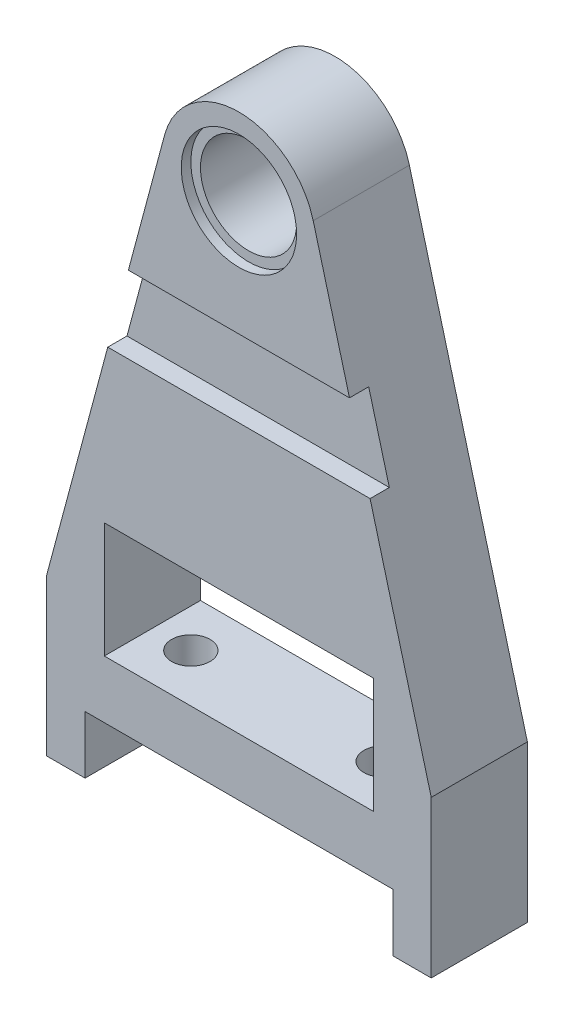
ISO-10303-21;
HEADER;
FILE_DESCRIPTION(('STEP AP214'),'2;1');
FILE_NAME('part.step','',(''),(''),'','','');
FILE_SCHEMA(('AUTOMOTIVE_DESIGN { 1 0 10303 214 1 1 1 1 }'));
ENDSEC;
DATA;
#1=APPLICATION_CONTEXT('core data for automotive mechanical design processes');
#2=APPLICATION_PROTOCOL_DEFINITION('international standard','automotive_design',2000,#1);
#3=PRODUCT_CONTEXT('',#1,'mechanical');
#4=PRODUCT('Part','Part','',(#3));
#5=PRODUCT_RELATED_PRODUCT_CATEGORY('part','',(#4));
#6=PRODUCT_DEFINITION_FORMATION('','',#4);
#7=PRODUCT_DEFINITION_CONTEXT('part definition',#1,'design');
#8=PRODUCT_DEFINITION('design','',#6,#7);
#9=PRODUCT_DEFINITION_SHAPE('','',#8);
#10=(LENGTH_UNIT() NAMED_UNIT(*) SI_UNIT(.MILLI.,.METRE.));
#11=(NAMED_UNIT(*) PLANE_ANGLE_UNIT() SI_UNIT($,.RADIAN.));
#12=(NAMED_UNIT(*) SI_UNIT($,.STERADIAN.) SOLID_ANGLE_UNIT());
#13=UNCERTAINTY_MEASURE_WITH_UNIT(LENGTH_MEASURE(1.E-05),#10,'distance_accuracy_value','');
#14=(GEOMETRIC_REPRESENTATION_CONTEXT(3) GLOBAL_UNCERTAINTY_ASSIGNED_CONTEXT((#13)) GLOBAL_UNIT_ASSIGNED_CONTEXT((#10,
#11,#12)) REPRESENTATION_CONTEXT('',''));
#15=CARTESIAN_POINT('',(0.,0.,0.));
#16=DIRECTION('',(0.,0.,1.));
#17=DIRECTION('',(1.,0.,0.));
#18=AXIS2_PLACEMENT_3D('',#15,#16,#17);
#19=CARTESIAN_POINT('',(0.,0.,25.));
#20=DIRECTION('',(0.,0.,1.));
#21=DIRECTION('',(1.,0.,0.));
#22=AXIS2_PLACEMENT_3D('',#19,#20,#21);
#23=PLANE('',#22);
#24=DIRECTION('',(-1.,0.,0.));
#25=VECTOR('',#24,1.);
#26=CARTESIAN_POINT('',(-57.4879987622707,240.,25.));
#27=LINE('',#26,#25);
#28=CARTESIAN_POINT('',(57.4879987622707,240.,25.));
#29=VERTEX_POINT('',#28);
#30=CARTESIAN_POINT('',(-57.4879987622707,240.,25.));
#31=VERTEX_POINT('',#30);
#32=EDGE_CURVE('E319',#29,#31,#27,.T.);
#33=ORIENTED_EDGE('',*,*,#32,.F.);
#34=DIRECTION('',(-0.258819045102521,0.965925826289068,0.));
#35=VECTOR('',#34,1.);
#36=CARTESIAN_POINT('',(113.637033051563,30.4489512364351,25.));
#37=LINE('',#36,#35);
#38=CARTESIAN_POINT('',(38.6370330515627,310.352761804101,25.));
#39=VERTEX_POINT('',#38);
#40=EDGE_CURVE('E264',#29,#39,#37,.T.);
#41=ORIENTED_EDGE('',*,*,#40,.T.);
#42=CARTESIAN_POINT('',(0.,300.,25.));
#43=DIRECTION('',(0.,0.,1.));
#44=DIRECTION('',(1.,0.,0.));
#45=AXIS2_PLACEMENT_3D('',#42,#43,#44);
#46=CIRCLE('',#45,40.);
#47=CARTESIAN_POINT('',(-38.6370330515627,310.352761804101,25.));
#48=VERTEX_POINT('',#47);
#49=EDGE_CURVE('E267',#39,#48,#46,.T.);
#50=ORIENTED_EDGE('',*,*,#49,.T.);
#51=DIRECTION('',(0.258819045102521,0.965925826289068,0.));
#52=VECTOR('',#51,1.);
#53=CARTESIAN_POINT('',(-113.637033051563,30.4489512364351,25.));
#54=LINE('',#53,#52);
#55=EDGE_CURVE('E270',#31,#48,#54,.T.);
#56=ORIENTED_EDGE('',*,*,#55,.F.);
#57=EDGE_LOOP('',(#33,#41,#50,#56));
#58=FACE_BOUND('',#57,.T.);
#59=CARTESIAN_POINT('',(0.,300.,25.));
#60=DIRECTION('',(0.,0.,1.));
#61=DIRECTION('',(1.,0.,0.));
#62=AXIS2_PLACEMENT_3D('',#59,#60,#61);
#63=CIRCLE('',#62,30.);
#64=CARTESIAN_POINT('',(30.,300.,25.));
#65=VERTEX_POINT('',#64);
#66=EDGE_CURVE('E246',#65,#65,#63,.T.);
#67=ORIENTED_EDGE('',*,*,#66,.F.);
#68=EDGE_LOOP('',(#67));
#69=FACE_BOUND('',#68,.T.);
#70=ADVANCED_FACE('F33',(#58,#69),#23,.T.);
#71=CARTESIAN_POINT('',(0.,300.,25.));
#72=DIRECTION('',(0.,0.,-1.));
#73=DIRECTION('',(-1.,0.,0.));
#74=AXIS2_PLACEMENT_3D('',#71,#72,#73);
#75=CYLINDRICAL_SURFACE('',#74,25.);
#76=CARTESIAN_POINT('',(0.,300.,20.));
#77=DIRECTION('',(0.,0.,1.));
#78=DIRECTION('',(1.,0.,0.));
#79=AXIS2_PLACEMENT_3D('',#76,#77,#78);
#80=CIRCLE('',#79,25.);
#81=CARTESIAN_POINT('',(25.,300.,20.));
#82=VERTEX_POINT('',#81);
#83=EDGE_CURVE('E187',#82,#82,#80,.T.);
#84=ORIENTED_EDGE('',*,*,#83,.T.);
#85=EDGE_LOOP('',(#84));
#86=FACE_BOUND('',#85,.T.);
#87=CARTESIAN_POINT('',(0.,300.,-20.));
#88=DIRECTION('',(0.,0.,-1.));
#89=DIRECTION('',(-1.,0.,0.));
#90=AXIS2_PLACEMENT_3D('',#87,#88,#89);
#91=CIRCLE('',#90,25.);
#92=CARTESIAN_POINT('',(-25.,300.,-20.));
#93=VERTEX_POINT('',#92);
#94=EDGE_CURVE('E37',#93,#93,#91,.T.);
#95=ORIENTED_EDGE('',*,*,#94,.T.);
#96=EDGE_LOOP('',(#95));
#97=FACE_BOUND('',#96,.T.);
#98=ADVANCED_FACE('F35',(#86,#97),#75,.F.);
#99=CARTESIAN_POINT('',(113.637033051563,30.4489512364351,25.));
#100=DIRECTION('',(-0.965925826289068,-0.258819045102521,0.));
#101=DIRECTION('',(0.258819045102521,-0.965925826289068,0.));
#102=AXIS2_PLACEMENT_3D('',#99,#100,#101);
#103=PLANE('',#102);
#104=ORIENTED_EDGE('',*,*,#40,.F.);
#105=DIRECTION('',(0.,0.,1.));
#106=VECTOR('',#105,1.);
#107=CARTESIAN_POINT('',(57.4879987622707,240.,15.));
#108=LINE('',#107,#106);
#109=CARTESIAN_POINT('',(57.4879987622707,240.,15.));
#110=VERTEX_POINT('',#109);
#111=EDGE_CURVE('E326',#110,#29,#108,.T.);
#112=ORIENTED_EDGE('',*,*,#111,.F.);
#113=DIRECTION('',(-0.258819045102522,0.965925826289068,0.));
#114=VECTOR('',#113,1.);
#115=CARTESIAN_POINT('',(57.4879987622707,240.,15.));
#116=LINE('',#115,#114);
#117=CARTESIAN_POINT('',(68.2059664595157,200.,15.));
#118=VERTEX_POINT('',#117);
#119=EDGE_CURVE('E576',#118,#110,#116,.T.);
#120=ORIENTED_EDGE('',*,*,#119,.F.);
#121=DIRECTION('',(0.,0.,1.));
#122=VECTOR('',#121,1.);
#123=CARTESIAN_POINT('',(68.2059664595157,200.,15.));
#124=LINE('',#123,#122);
#125=CARTESIAN_POINT('',(68.2059664595157,200.,25.));
#126=VERTEX_POINT('',#125);
#127=EDGE_CURVE('E298',#118,#126,#124,.T.);
#128=ORIENTED_EDGE('',*,*,#127,.T.);
#129=CARTESIAN_POINT('',(100.,81.3430514493638,25.));
#130=VERTEX_POINT('',#129);
#131=EDGE_CURVE('E265',#130,#126,#37,.T.);
#132=ORIENTED_EDGE('',*,*,#131,.F.);
#133=DIRECTION('',(0.,0.,-1.));
#134=VECTOR('',#133,1.);
#135=CARTESIAN_POINT('',(100.,81.3430514493638,25.));
#136=LINE('',#135,#134);
#137=CARTESIAN_POINT('',(100.,81.3430514493638,-25.));
#138=VERTEX_POINT('',#137);
#139=EDGE_CURVE('E222',#130,#138,#136,.T.);
#140=ORIENTED_EDGE('',*,*,#139,.T.);
#141=DIRECTION('',(-0.258819045102521,0.965925826289068,0.));
#142=VECTOR('',#141,1.);
#143=CARTESIAN_POINT('',(113.637033051563,30.4489512364351,-25.));
#144=LINE('',#143,#142);
#145=CARTESIAN_POINT('',(38.6370330515627,310.352761804101,-25.));
#146=VERTEX_POINT('',#145);
#147=EDGE_CURVE('E196',#138,#146,#144,.T.);
#148=ORIENTED_EDGE('',*,*,#147,.T.);
#149=DIRECTION('',(0.,0.,-1.));
#150=VECTOR('',#149,1.);
#151=CARTESIAN_POINT('',(38.6370330515627,310.352761804101,25.));
#152=LINE('',#151,#150);
#153=EDGE_CURVE('E11',#39,#146,#152,.T.);
#154=ORIENTED_EDGE('',*,*,#153,.F.);
#155=EDGE_LOOP('',(#104,#112,#120,#128,#132,#140,#148,#154));
#156=FACE_BOUND('',#155,.T.);
#157=ADVANCED_FACE('F294',(#156),#103,.F.);
#158=CARTESIAN_POINT('',(0.,300.,25.));
#159=DIRECTION('',(0.,0.,-1.));
#160=DIRECTION('',(-1.,0.,0.));
#161=AXIS2_PLACEMENT_3D('',#158,#159,#160);
#162=CYLINDRICAL_SURFACE('',#161,40.);
#163=CARTESIAN_POINT('',(0.,300.,-25.));
#164=DIRECTION('',(0.,0.,1.));
#165=DIRECTION('',(1.,0.,0.));
#166=AXIS2_PLACEMENT_3D('',#163,#164,#165);
#167=CIRCLE('',#166,40.);
#168=CARTESIAN_POINT('',(-38.6370330515627,310.352761804101,-25.));
#169=VERTEX_POINT('',#168);
#170=EDGE_CURVE('E199',#146,#169,#167,.T.);
#171=ORIENTED_EDGE('',*,*,#170,.T.);
#172=DIRECTION('',(0.,0.,-1.));
#173=VECTOR('',#172,1.);
#174=CARTESIAN_POINT('',(-38.6370330515627,310.352761804101,25.));
#175=LINE('',#174,#173);
#176=EDGE_CURVE('E42',#48,#169,#175,.T.);
#177=ORIENTED_EDGE('',*,*,#176,.F.);
#178=ORIENTED_EDGE('',*,*,#49,.F.);
#179=ORIENTED_EDGE('',*,*,#153,.T.);
#180=EDGE_LOOP('',(#171,#177,#178,#179));
#181=FACE_BOUND('',#180,.T.);
#182=ADVANCED_FACE('F340',(#181),#162,.T.);
#183=CARTESIAN_POINT('',(-113.637033051563,30.4489512364351,25.));
#184=DIRECTION('',(-0.965925826289068,0.258819045102521,0.));
#185=DIRECTION('',(-0.258819045102521,-0.965925826289068,0.));
#186=AXIS2_PLACEMENT_3D('',#183,#184,#185);
#187=PLANE('',#186);
#188=DIRECTION('',(0.,0.,1.));
#189=VECTOR('',#188,1.);
#190=CARTESIAN_POINT('',(-57.4879987622707,240.,15.));
#191=LINE('',#190,#189);
#192=CARTESIAN_POINT('',(-57.4879987622707,240.,15.));
#193=VERTEX_POINT('',#192);
#194=EDGE_CURVE('E323',#193,#31,#191,.T.);
#195=ORIENTED_EDGE('',*,*,#194,.T.);
#196=ORIENTED_EDGE('',*,*,#55,.T.);
#197=ORIENTED_EDGE('',*,*,#176,.T.);
#198=DIRECTION('',(0.258819045102521,0.965925826289068,0.));
#199=VECTOR('',#198,1.);
#200=CARTESIAN_POINT('',(-113.637033051563,30.4489512364351,-25.));
#201=LINE('',#200,#199);
#202=CARTESIAN_POINT('',(-100.,81.3430514493638,-25.));
#203=VERTEX_POINT('',#202);
#204=EDGE_CURVE('E202',#203,#169,#201,.T.);
#205=ORIENTED_EDGE('',*,*,#204,.F.);
#206=DIRECTION('',(0.,0.,-1.));
#207=VECTOR('',#206,1.);
#208=CARTESIAN_POINT('',(-100.,81.3430514493638,25.));
#209=LINE('',#208,#207);
#210=CARTESIAN_POINT('',(-100.,81.3430514493638,25.));
#211=VERTEX_POINT('',#210);
#212=EDGE_CURVE('E233',#211,#203,#209,.T.);
#213=ORIENTED_EDGE('',*,*,#212,.F.);
#214=CARTESIAN_POINT('',(-68.2059664595157,200.,25.));
#215=VERTEX_POINT('',#214);
#216=EDGE_CURVE('E271',#211,#215,#54,.T.);
#217=ORIENTED_EDGE('',*,*,#216,.T.);
#218=DIRECTION('',(0.,0.,1.));
#219=VECTOR('',#218,1.);
#220=CARTESIAN_POINT('',(-68.2059664595157,200.,15.));
#221=LINE('',#220,#219);
#222=CARTESIAN_POINT('',(-68.2059664595157,200.,15.));
#223=VERTEX_POINT('',#222);
#224=EDGE_CURVE('E50',#223,#215,#221,.T.);
#225=ORIENTED_EDGE('',*,*,#224,.F.);
#226=DIRECTION('',(-0.258819045102521,-0.965925826289068,0.));
#227=VECTOR('',#226,1.);
#228=CARTESIAN_POINT('',(-68.2059664595157,200.,15.));
#229=LINE('',#228,#227);
#230=EDGE_CURVE('E329',#193,#223,#229,.T.);
#231=ORIENTED_EDGE('',*,*,#230,.F.);
#232=EDGE_LOOP('',(#195,#196,#197,#205,#213,#217,#225,#231));
#233=FACE_BOUND('',#232,.T.);
#234=ADVANCED_FACE('F333',(#233),#187,.T.);
#235=CARTESIAN_POINT('',(-100.,0.,25.));
#236=DIRECTION('',(-1.,0.,0.));
#237=DIRECTION('',(0.,0.,1.));
#238=AXIS2_PLACEMENT_3D('',#235,#236,#237);
#239=PLANE('',#238);
#240=DIRECTION('',(0.,1.,0.));
#241=VECTOR('',#240,1.);
#242=CARTESIAN_POINT('',(-100.,0.,-25.));
#243=LINE('',#242,#241);
#244=CARTESIAN_POINT('',(-100.,0.,-25.));
#245=VERTEX_POINT('',#244);
#246=EDGE_CURVE('E205',#245,#203,#243,.T.);
#247=ORIENTED_EDGE('',*,*,#246,.F.);
#248=DIRECTION('',(0.,0.,-1.));
#249=VECTOR('',#248,1.);
#250=CARTESIAN_POINT('',(-100.,0.,25.));
#251=LINE('',#250,#249);
#252=CARTESIAN_POINT('',(-100.,0.,25.));
#253=VERTEX_POINT('',#252);
#254=EDGE_CURVE('E231',#253,#245,#251,.T.);
#255=ORIENTED_EDGE('',*,*,#254,.F.);
#256=DIRECTION('',(0.,1.,0.));
#257=VECTOR('',#256,1.);
#258=CARTESIAN_POINT('',(-100.,0.,25.));
#259=LINE('',#258,#257);
#260=EDGE_CURVE('E274',#253,#211,#259,.T.);
#261=ORIENTED_EDGE('',*,*,#260,.T.);
#262=ORIENTED_EDGE('',*,*,#212,.T.);
#263=EDGE_LOOP('',(#247,#255,#261,#262));
#264=FACE_BOUND('',#263,.T.);
#265=ADVANCED_FACE('F345',(#264),#239,.T.);
#266=CARTESIAN_POINT('',(0.,0.,25.));
#267=DIRECTION('',(0.,-1.,0.));
#268=DIRECTION('',(1.,0.,0.));
#269=AXIS2_PLACEMENT_3D('',#266,#267,#268);
#270=PLANE('',#269);
#271=DIRECTION('',(-1.,0.,0.));
#272=VECTOR('',#271,1.);
#273=CARTESIAN_POINT('',(0.,0.,-25.));
#274=LINE('',#273,#272);
#275=CARTESIAN_POINT('',(-80.,0.,-25.));
#276=VERTEX_POINT('',#275);
#277=EDGE_CURVE('E208',#276,#245,#274,.T.);
#278=ORIENTED_EDGE('',*,*,#277,.F.);
#279=DIRECTION('',(0.,0.,-1.));
#280=VECTOR('',#279,1.);
#281=CARTESIAN_POINT('',(-80.,0.,25.));
#282=LINE('',#281,#280);
#283=CARTESIAN_POINT('',(-80.,0.,25.));
#284=VERTEX_POINT('',#283);
#285=EDGE_CURVE('E229',#284,#276,#282,.T.);
#286=ORIENTED_EDGE('',*,*,#285,.F.);
#287=DIRECTION('',(-1.,0.,0.));
#288=VECTOR('',#287,1.);
#289=CARTESIAN_POINT('',(0.,0.,25.));
#290=LINE('',#289,#288);
#291=EDGE_CURVE('E277',#284,#253,#290,.T.);
#292=ORIENTED_EDGE('',*,*,#291,.T.);
#293=ORIENTED_EDGE('',*,*,#254,.T.);
#294=EDGE_LOOP('',(#278,#286,#292,#293));
#295=FACE_BOUND('',#294,.T.);
#296=ADVANCED_FACE('F349',(#295),#270,.T.);
#297=CARTESIAN_POINT('',(-80.,0.,25.));
#298=DIRECTION('',(1.,0.,0.));
#299=DIRECTION('',(0.,0.,-1.));
#300=AXIS2_PLACEMENT_3D('',#297,#298,#299);
#301=PLANE('',#300);
#302=DIRECTION('',(0.,-1.,0.));
#303=VECTOR('',#302,1.);
#304=CARTESIAN_POINT('',(-80.,0.,-25.));
#305=LINE('',#304,#303);
#306=CARTESIAN_POINT('',(-80.,30.,-25.));
#307=VERTEX_POINT('',#306);
#308=EDGE_CURVE('E211',#307,#276,#305,.T.);
#309=ORIENTED_EDGE('',*,*,#308,.F.);
#310=DIRECTION('',(0.,0.,-1.));
#311=VECTOR('',#310,1.);
#312=CARTESIAN_POINT('',(-80.,30.,25.));
#313=LINE('',#312,#311);
#314=CARTESIAN_POINT('',(-80.,30.,25.));
#315=VERTEX_POINT('',#314);
#316=EDGE_CURVE('E227',#315,#307,#313,.T.);
#317=ORIENTED_EDGE('',*,*,#316,.F.);
#318=DIRECTION('',(0.,-1.,0.));
#319=VECTOR('',#318,1.);
#320=CARTESIAN_POINT('',(-80.,0.,25.));
#321=LINE('',#320,#319);
#322=EDGE_CURVE('E280',#315,#284,#321,.T.);
#323=ORIENTED_EDGE('',*,*,#322,.T.);
#324=ORIENTED_EDGE('',*,*,#285,.T.);
#325=EDGE_LOOP('',(#309,#317,#323,#324));
#326=FACE_BOUND('',#325,.T.);
#327=ADVANCED_FACE('F351',(#326),#301,.T.);
#328=CARTESIAN_POINT('',(0.,30.,25.));
#329=DIRECTION('',(0.,-1.,0.));
#330=DIRECTION('',(0.,0.,-1.));
#331=AXIS2_PLACEMENT_3D('',#328,#329,#330);
#332=PLANE('',#331);
#333=CARTESIAN_POINT('',(-50.,30.,0.));
#334=DIRECTION('',(0.,-1.,0.));
#335=DIRECTION('',(0.,0.,-1.));
#336=AXIS2_PLACEMENT_3D('',#333,#334,#335);
#337=CIRCLE('',#336,10.);
#338=CARTESIAN_POINT('',(-50.,30.,-10.));
#339=VERTEX_POINT('',#338);
#340=EDGE_CURVE('E560',#339,#339,#337,.T.);
#341=ORIENTED_EDGE('',*,*,#340,.F.);
#342=EDGE_LOOP('',(#341));
#343=FACE_BOUND('',#342,.T.);
#344=CARTESIAN_POINT('',(50.,30.,0.));
#345=DIRECTION('',(0.,-1.,0.));
#346=DIRECTION('',(0.,0.,1.));
#347=AXIS2_PLACEMENT_3D('',#344,#345,#346);
#348=CIRCLE('',#347,10.);
#349=CARTESIAN_POINT('',(50.,30.,10.));
#350=VERTEX_POINT('',#349);
#351=EDGE_CURVE('E569',#350,#350,#348,.T.);
#352=ORIENTED_EDGE('',*,*,#351,.F.);
#353=EDGE_LOOP('',(#352));
#354=FACE_BOUND('',#353,.T.);
#355=DIRECTION('',(-1.,0.,0.));
#356=VECTOR('',#355,1.);
#357=CARTESIAN_POINT('',(0.,30.,-25.));
#358=LINE('',#357,#356);
#359=CARTESIAN_POINT('',(80.,30.,-25.));
#360=VERTEX_POINT('',#359);
#361=EDGE_CURVE('E214',#360,#307,#358,.T.);
#362=ORIENTED_EDGE('',*,*,#361,.F.);
#363=DIRECTION('',(0.,0.,-1.));
#364=VECTOR('',#363,1.);
#365=CARTESIAN_POINT('',(80.,30.,25.));
#366=LINE('',#365,#364);
#367=CARTESIAN_POINT('',(80.,30.,25.));
#368=VERTEX_POINT('',#367);
#369=EDGE_CURVE('E174',#368,#360,#366,.T.);
#370=ORIENTED_EDGE('',*,*,#369,.F.);
#371=DIRECTION('',(-1.,0.,0.));
#372=VECTOR('',#371,1.);
#373=CARTESIAN_POINT('',(0.,30.,25.));
#374=LINE('',#373,#372);
#375=EDGE_CURVE('E164',#368,#315,#374,.T.);
#376=ORIENTED_EDGE('',*,*,#375,.T.);
#377=ORIENTED_EDGE('',*,*,#316,.T.);
#378=EDGE_LOOP('',(#362,#370,#376,#377));
#379=FACE_BOUND('',#378,.T.);
#380=ADVANCED_FACE('F284',(#343,#354,#379),#332,.T.);
#381=CARTESIAN_POINT('',(80.,0.,25.));
#382=DIRECTION('',(1.,0.,0.));
#383=DIRECTION('',(0.,0.,-1.));
#384=AXIS2_PLACEMENT_3D('',#381,#382,#383);
#385=PLANE('',#384);
#386=DIRECTION('',(0.,-1.,0.));
#387=VECTOR('',#386,1.);
#388=CARTESIAN_POINT('',(80.,0.,-25.));
#389=LINE('',#388,#387);
#390=CARTESIAN_POINT('',(80.,0.,-25.));
#391=VERTEX_POINT('',#390);
#392=EDGE_CURVE('E171',#360,#391,#389,.T.);
#393=ORIENTED_EDGE('',*,*,#392,.T.);
#394=DIRECTION('',(0.,0.,-1.));
#395=VECTOR('',#394,1.);
#396=CARTESIAN_POINT('',(80.,0.,25.));
#397=LINE('',#396,#395);
#398=CARTESIAN_POINT('',(80.,0.,25.));
#399=VERTEX_POINT('',#398);
#400=EDGE_CURVE('E168',#399,#391,#397,.T.);
#401=ORIENTED_EDGE('',*,*,#400,.F.);
#402=DIRECTION('',(0.,-1.,0.));
#403=VECTOR('',#402,1.);
#404=CARTESIAN_POINT('',(80.,0.,25.));
#405=LINE('',#404,#403);
#406=EDGE_CURVE('E155',#368,#399,#405,.T.);
#407=ORIENTED_EDGE('',*,*,#406,.F.);
#408=ORIENTED_EDGE('',*,*,#369,.T.);
#409=EDGE_LOOP('',(#393,#401,#407,#408));
#410=FACE_BOUND('',#409,.T.);
#411=ADVANCED_FACE('F169',(#410),#385,.F.);
#412=CARTESIAN_POINT('',(0.,0.,25.));
#413=DIRECTION('',(0.,1.,0.));
#414=DIRECTION('',(-1.,0.,0.));
#415=AXIS2_PLACEMENT_3D('',#412,#413,#414);
#416=PLANE('',#415);
#417=DIRECTION('',(1.,0.,0.));
#418=VECTOR('',#417,1.);
#419=CARTESIAN_POINT('',(0.,0.,-25.));
#420=LINE('',#419,#418);
#421=CARTESIAN_POINT('',(100.,0.,-25.));
#422=VERTEX_POINT('',#421);
#423=EDGE_CURVE('E218',#391,#422,#420,.T.);
#424=ORIENTED_EDGE('',*,*,#423,.T.);
#425=DIRECTION('',(0.,0.,-1.));
#426=VECTOR('',#425,1.);
#427=CARTESIAN_POINT('',(100.,0.,25.));
#428=LINE('',#427,#426);
#429=CARTESIAN_POINT('',(100.,0.,25.));
#430=VERTEX_POINT('',#429);
#431=EDGE_CURVE('E175',#430,#422,#428,.T.);
#432=ORIENTED_EDGE('',*,*,#431,.F.);
#433=DIRECTION('',(1.,0.,0.));
#434=VECTOR('',#433,1.);
#435=CARTESIAN_POINT('',(0.,0.,25.));
#436=LINE('',#435,#434);
#437=EDGE_CURVE('E160',#399,#430,#436,.T.);
#438=ORIENTED_EDGE('',*,*,#437,.F.);
#439=ORIENTED_EDGE('',*,*,#400,.T.);
#440=EDGE_LOOP('',(#424,#432,#438,#439));
#441=FACE_BOUND('',#440,.T.);
#442=ADVANCED_FACE('F177',(#441),#416,.F.);
#443=CARTESIAN_POINT('',(0.,60.,25.));
#444=DIRECTION('',(0.,-1.,0.));
#445=DIRECTION('',(0.,0.,-1.));
#446=AXIS2_PLACEMENT_3D('',#443,#444,#445);
#447=PLANE('',#446);
#448=CARTESIAN_POINT('',(-50.,60.,0.));
#449=DIRECTION('',(0.,-1.,0.));
#450=DIRECTION('',(0.,0.,-1.));
#451=AXIS2_PLACEMENT_3D('',#448,#449,#450);
#452=CIRCLE('',#451,10.);
#453=CARTESIAN_POINT('',(-50.,60.,-10.));
#454=VERTEX_POINT('',#453);
#455=EDGE_CURVE('E563',#454,#454,#452,.F.);
#456=ORIENTED_EDGE('',*,*,#455,.F.);
#457=EDGE_LOOP('',(#456));
#458=FACE_BOUND('',#457,.T.);
#459=CARTESIAN_POINT('',(50.,60.,0.));
#460=DIRECTION('',(0.,-1.,0.));
#461=DIRECTION('',(0.,0.,-1.));
#462=AXIS2_PLACEMENT_3D('',#459,#460,#461);
#463=CIRCLE('',#462,10.);
#464=CARTESIAN_POINT('',(50.,60.,-10.));
#465=VERTEX_POINT('',#464);
#466=EDGE_CURVE('E566',#465,#465,#463,.F.);
#467=ORIENTED_EDGE('',*,*,#466,.F.);
#468=EDGE_LOOP('',(#467));
#469=FACE_BOUND('',#468,.T.);
#470=DIRECTION('',(-1.,0.,0.));
#471=VECTOR('',#470,1.);
#472=CARTESIAN_POINT('',(0.,60.,-25.));
#473=LINE('',#472,#471);
#474=CARTESIAN_POINT('',(70.,60.,-25.));
#475=VERTEX_POINT('',#474);
#476=CARTESIAN_POINT('',(-70.,60.,-25.));
#477=VERTEX_POINT('',#476);
#478=EDGE_CURVE('E183',#475,#477,#473,.T.);
#479=ORIENTED_EDGE('',*,*,#478,.T.);
#480=DIRECTION('',(0.,0.,-1.));
#481=VECTOR('',#480,1.);
#482=CARTESIAN_POINT('',(-70.,60.,25.));
#483=LINE('',#482,#481);
#484=CARTESIAN_POINT('',(-70.,60.,25.));
#485=VERTEX_POINT('',#484);
#486=EDGE_CURVE('E224',#485,#477,#483,.T.);
#487=ORIENTED_EDGE('',*,*,#486,.F.);
#488=DIRECTION('',(-1.,0.,0.));
#489=VECTOR('',#488,1.);
#490=CARTESIAN_POINT('',(0.,60.,25.));
#491=LINE('',#490,#489);
#492=CARTESIAN_POINT('',(70.,60.,25.));
#493=VERTEX_POINT('',#492);
#494=EDGE_CURVE('E221',#493,#485,#491,.T.);
#495=ORIENTED_EDGE('',*,*,#494,.F.);
#496=DIRECTION('',(0.,0.,-1.));
#497=VECTOR('',#496,1.);
#498=CARTESIAN_POINT('',(70.,60.,25.));
#499=LINE('',#498,#497);
#500=EDGE_CURVE('E179',#493,#475,#499,.T.);
#501=ORIENTED_EDGE('',*,*,#500,.T.);
#502=EDGE_LOOP('',(#479,#487,#495,#501));
#503=FACE_BOUND('',#502,.T.);
#504=ADVANCED_FACE('F387',(#458,#469,#503),#447,.F.);
#505=CARTESIAN_POINT('',(-70.,0.,25.));
#506=DIRECTION('',(-1.,0.,0.));
#507=DIRECTION('',(0.,0.,1.));
#508=AXIS2_PLACEMENT_3D('',#505,#506,#507);
#509=PLANE('',#508);
#510=DIRECTION('',(0.,1.,0.));
#511=VECTOR('',#510,1.);
#512=CARTESIAN_POINT('',(-70.,0.,-25.));
#513=LINE('',#512,#511);
#514=CARTESIAN_POINT('',(-70.,120.,-25.));
#515=VERTEX_POINT('',#514);
#516=EDGE_CURVE('E186',#477,#515,#513,.T.);
#517=ORIENTED_EDGE('',*,*,#516,.T.);
#518=DIRECTION('',(0.,0.,-1.));
#519=VECTOR('',#518,1.);
#520=CARTESIAN_POINT('',(-70.,120.,25.));
#521=LINE('',#520,#519);
#522=CARTESIAN_POINT('',(-70.,120.,25.));
#523=VERTEX_POINT('',#522);
#524=EDGE_CURVE('E239',#523,#515,#521,.T.);
#525=ORIENTED_EDGE('',*,*,#524,.F.);
#526=DIRECTION('',(0.,1.,0.));
#527=VECTOR('',#526,1.);
#528=CARTESIAN_POINT('',(-70.,0.,25.));
#529=LINE('',#528,#527);
#530=EDGE_CURVE('E119',#485,#523,#529,.T.);
#531=ORIENTED_EDGE('',*,*,#530,.F.);
#532=ORIENTED_EDGE('',*,*,#486,.T.);
#533=EDGE_LOOP('',(#517,#525,#531,#532));
#534=FACE_BOUND('',#533,.T.);
#535=ADVANCED_FACE('F405',(#534),#509,.F.);
#536=CARTESIAN_POINT('',(0.,120.,25.));
#537=DIRECTION('',(0.,-1.,0.));
#538=DIRECTION('',(0.,0.,-1.));
#539=AXIS2_PLACEMENT_3D('',#536,#537,#538);
#540=PLANE('',#539);
#541=DIRECTION('',(-1.,0.,0.));
#542=VECTOR('',#541,1.);
#543=CARTESIAN_POINT('',(0.,120.,-25.));
#544=LINE('',#543,#542);
#545=CARTESIAN_POINT('',(70.,120.,-25.));
#546=VERTEX_POINT('',#545);
#547=EDGE_CURVE('E190',#546,#515,#544,.T.);
#548=ORIENTED_EDGE('',*,*,#547,.F.);
#549=DIRECTION('',(0.,0.,-1.));
#550=VECTOR('',#549,1.);
#551=CARTESIAN_POINT('',(70.,120.,25.));
#552=LINE('',#551,#550);
#553=CARTESIAN_POINT('',(70.,120.,25.));
#554=VERTEX_POINT('',#553);
#555=EDGE_CURVE('E237',#554,#546,#552,.T.);
#556=ORIENTED_EDGE('',*,*,#555,.F.);
#557=DIRECTION('',(-1.,0.,0.));
#558=VECTOR('',#557,1.);
#559=CARTESIAN_POINT('',(0.,120.,25.));
#560=LINE('',#559,#558);
#561=EDGE_CURVE('E258',#554,#523,#560,.T.);
#562=ORIENTED_EDGE('',*,*,#561,.T.);
#563=ORIENTED_EDGE('',*,*,#524,.T.);
#564=EDGE_LOOP('',(#548,#556,#562,#563));
#565=FACE_BOUND('',#564,.T.);
#566=ADVANCED_FACE('F381',(#565),#540,.T.);
#567=CARTESIAN_POINT('',(70.,0.,25.));
#568=DIRECTION('',(-1.,0.,0.));
#569=DIRECTION('',(0.,0.,1.));
#570=AXIS2_PLACEMENT_3D('',#567,#568,#569);
#571=PLANE('',#570);
#572=DIRECTION('',(0.,1.,0.));
#573=VECTOR('',#572,1.);
#574=CARTESIAN_POINT('',(70.,0.,-25.));
#575=LINE('',#574,#573);
#576=EDGE_CURVE('E193',#475,#546,#575,.T.);
#577=ORIENTED_EDGE('',*,*,#576,.F.);
#578=ORIENTED_EDGE('',*,*,#500,.F.);
#579=DIRECTION('',(0.,1.,0.));
#580=VECTOR('',#579,1.);
#581=CARTESIAN_POINT('',(70.,0.,25.));
#582=LINE('',#581,#580);
#583=EDGE_CURVE('E261',#493,#554,#582,.T.);
#584=ORIENTED_EDGE('',*,*,#583,.T.);
#585=ORIENTED_EDGE('',*,*,#555,.T.);
#586=EDGE_LOOP('',(#577,#578,#584,#585));
#587=FACE_BOUND('',#586,.T.);
#588=ADVANCED_FACE('F376',(#587),#571,.T.);
#589=CARTESIAN_POINT('',(100.,0.,25.));
#590=DIRECTION('',(-1.,0.,0.));
#591=DIRECTION('',(0.,0.,1.));
#592=AXIS2_PLACEMENT_3D('',#589,#590,#591);
#593=PLANE('',#592);
#594=DIRECTION('',(0.,1.,0.));
#595=VECTOR('',#594,1.);
#596=CARTESIAN_POINT('',(100.,0.,-25.));
#597=LINE('',#596,#595);
#598=EDGE_CURVE('E110',#422,#138,#597,.T.);
#599=ORIENTED_EDGE('',*,*,#598,.T.);
#600=ORIENTED_EDGE('',*,*,#139,.F.);
#601=DIRECTION('',(0.,1.,0.));
#602=VECTOR('',#601,1.);
#603=CARTESIAN_POINT('',(100.,0.,25.));
#604=LINE('',#603,#602);
#605=EDGE_CURVE('E59',#430,#130,#604,.T.);
#606=ORIENTED_EDGE('',*,*,#605,.F.);
#607=ORIENTED_EDGE('',*,*,#431,.T.);
#608=EDGE_LOOP('',(#599,#600,#606,#607));
#609=FACE_BOUND('',#608,.T.);
#610=ADVANCED_FACE('F289',(#609),#593,.F.);
#611=DIRECTION('',(1.,0.,0.));
#612=VECTOR('',#611,1.);
#613=CARTESIAN_POINT('',(68.2059664595157,200.,25.));
#614=LINE('',#613,#612);
#615=EDGE_CURVE('E300',#215,#126,#614,.T.);
#616=ORIENTED_EDGE('',*,*,#615,.F.);
#617=ORIENTED_EDGE('',*,*,#216,.F.);
#618=ORIENTED_EDGE('',*,*,#260,.F.);
#619=ORIENTED_EDGE('',*,*,#291,.F.);
#620=ORIENTED_EDGE('',*,*,#322,.F.);
#621=ORIENTED_EDGE('',*,*,#375,.F.);
#622=ORIENTED_EDGE('',*,*,#406,.T.);
#623=ORIENTED_EDGE('',*,*,#437,.T.);
#624=ORIENTED_EDGE('',*,*,#605,.T.);
#625=ORIENTED_EDGE('',*,*,#131,.T.);
#626=EDGE_LOOP('',(#616,#617,#618,#619,#620,#621,#622,#623,#624,#625));
#627=FACE_BOUND('',#626,.T.);
#628=ORIENTED_EDGE('',*,*,#494,.T.);
#629=ORIENTED_EDGE('',*,*,#530,.T.);
#630=ORIENTED_EDGE('',*,*,#561,.F.);
#631=ORIENTED_EDGE('',*,*,#583,.F.);
#632=EDGE_LOOP('',(#628,#629,#630,#631));
#633=FACE_BOUND('',#632,.T.);
#634=ADVANCED_FACE('F157',(#627,#633),#23,.T.);
#635=CARTESIAN_POINT('',(0.,0.,-25.));
#636=DIRECTION('',(0.,0.,1.));
#637=DIRECTION('',(1.,0.,0.));
#638=AXIS2_PLACEMENT_3D('',#635,#636,#637);
#639=PLANE('',#638);
#640=CARTESIAN_POINT('',(0.,300.,-25.));
#641=DIRECTION('',(0.,0.,1.));
#642=DIRECTION('',(1.,0.,0.));
#643=AXIS2_PLACEMENT_3D('',#640,#641,#642);
#644=CIRCLE('',#643,30.);
#645=CARTESIAN_POINT('',(30.,300.,-25.));
#646=VERTEX_POINT('',#645);
#647=EDGE_CURVE('E253',#646,#646,#644,.T.);
#648=ORIENTED_EDGE('',*,*,#647,.T.);
#649=EDGE_LOOP('',(#648));
#650=FACE_BOUND('',#649,.T.);
#651=ORIENTED_EDGE('',*,*,#478,.F.);
#652=ORIENTED_EDGE('',*,*,#576,.T.);
#653=ORIENTED_EDGE('',*,*,#547,.T.);
#654=ORIENTED_EDGE('',*,*,#516,.F.);
#655=EDGE_LOOP('',(#651,#652,#653,#654));
#656=FACE_BOUND('',#655,.T.);
#657=ORIENTED_EDGE('',*,*,#147,.F.);
#658=ORIENTED_EDGE('',*,*,#598,.F.);
#659=ORIENTED_EDGE('',*,*,#423,.F.);
#660=ORIENTED_EDGE('',*,*,#392,.F.);
#661=ORIENTED_EDGE('',*,*,#361,.T.);
#662=ORIENTED_EDGE('',*,*,#308,.T.);
#663=ORIENTED_EDGE('',*,*,#277,.T.);
#664=ORIENTED_EDGE('',*,*,#246,.T.);
#665=ORIENTED_EDGE('',*,*,#204,.T.);
#666=ORIENTED_EDGE('',*,*,#170,.F.);
#667=EDGE_LOOP('',(#657,#658,#659,#660,#661,#662,#663,#664,#665,#666));
#668=FACE_BOUND('',#667,.T.);
#669=ADVANCED_FACE('F288',(#650,#656,#668),#639,.F.);
#670=CARTESIAN_POINT('',(0.,300.,20.));
#671=DIRECTION('',(0.,0.,1.));
#672=DIRECTION('',(1.,0.,0.));
#673=AXIS2_PLACEMENT_3D('',#670,#671,#672);
#674=CYLINDRICAL_SURFACE('',#673,30.);
#675=CARTESIAN_POINT('',(0.,300.,20.));
#676=DIRECTION('',(0.,0.,1.));
#677=DIRECTION('',(1.,0.,0.));
#678=AXIS2_PLACEMENT_3D('',#675,#676,#677);
#679=CIRCLE('',#678,30.);
#680=CARTESIAN_POINT('',(30.,300.,20.));
#681=VERTEX_POINT('',#680);
#682=EDGE_CURVE('E242',#681,#681,#679,.T.);
#683=ORIENTED_EDGE('',*,*,#682,.F.);
#684=EDGE_LOOP('',(#683));
#685=FACE_BOUND('',#684,.T.);
#686=ORIENTED_EDGE('',*,*,#66,.T.);
#687=EDGE_LOOP('',(#686));
#688=FACE_BOUND('',#687,.T.);
#689=ADVANCED_FACE('F374',(#685,#688),#674,.F.);
#690=CARTESIAN_POINT('',(0.,300.,20.));
#691=DIRECTION('',(0.,0.,1.));
#692=DIRECTION('',(1.,0.,0.));
#693=AXIS2_PLACEMENT_3D('',#690,#691,#692);
#694=PLANE('',#693);
#695=ORIENTED_EDGE('',*,*,#83,.F.);
#696=EDGE_LOOP('',(#695));
#697=FACE_BOUND('',#696,.T.);
#698=ORIENTED_EDGE('',*,*,#682,.T.);
#699=EDGE_LOOP('',(#698));
#700=FACE_BOUND('',#699,.T.);
#701=ADVANCED_FACE('F438',(#697,#700),#694,.T.);
#702=CARTESIAN_POINT('',(0.,300.,-20.));
#703=DIRECTION('',(0.,0.,-1.));
#704=DIRECTION('',(-1.,0.,0.));
#705=AXIS2_PLACEMENT_3D('',#702,#703,#704);
#706=CYLINDRICAL_SURFACE('',#705,30.);
#707=CARTESIAN_POINT('',(0.,300.,-20.));
#708=DIRECTION('',(0.,0.,1.));
#709=DIRECTION('',(1.,0.,0.));
#710=AXIS2_PLACEMENT_3D('',#707,#708,#709);
#711=CIRCLE('',#710,30.);
#712=CARTESIAN_POINT('',(30.,300.,-20.));
#713=VERTEX_POINT('',#712);
#714=EDGE_CURVE('E582',#713,#713,#711,.T.);
#715=ORIENTED_EDGE('',*,*,#714,.T.);
#716=EDGE_LOOP('',(#715));
#717=FACE_BOUND('',#716,.T.);
#718=ORIENTED_EDGE('',*,*,#647,.F.);
#719=EDGE_LOOP('',(#718));
#720=FACE_BOUND('',#719,.T.);
#721=ADVANCED_FACE('F448',(#717,#720),#706,.F.);
#722=CARTESIAN_POINT('',(0.,300.,-20.));
#723=DIRECTION('',(0.,0.,-1.));
#724=DIRECTION('',(1.,0.,0.));
#725=AXIS2_PLACEMENT_3D('',#722,#723,#724);
#726=PLANE('',#725);
#727=ORIENTED_EDGE('',*,*,#94,.F.);
#728=EDGE_LOOP('',(#727));
#729=FACE_BOUND('',#728,.T.);
#730=ORIENTED_EDGE('',*,*,#714,.F.);
#731=EDGE_LOOP('',(#730));
#732=FACE_BOUND('',#731,.T.);
#733=ADVANCED_FACE('F470',(#729,#732),#726,.T.);
#734=CARTESIAN_POINT('',(-57.4879987622707,240.,15.));
#735=DIRECTION('',(0.,1.,0.));
#736=DIRECTION('',(0.,0.,1.));
#737=AXIS2_PLACEMENT_3D('',#734,#735,#736);
#738=PLANE('',#737);
#739=ORIENTED_EDGE('',*,*,#32,.T.);
#740=ORIENTED_EDGE('',*,*,#194,.F.);
#741=DIRECTION('',(-1.,0.,0.));
#742=VECTOR('',#741,1.);
#743=CARTESIAN_POINT('',(-57.4879987622707,240.,15.));
#744=LINE('',#743,#742);
#745=EDGE_CURVE('E578',#110,#193,#744,.T.);
#746=ORIENTED_EDGE('',*,*,#745,.F.);
#747=ORIENTED_EDGE('',*,*,#111,.T.);
#748=EDGE_LOOP('',(#739,#740,#746,#747));
#749=FACE_BOUND('',#748,.T.);
#750=ADVANCED_FACE('F321',(#749),#738,.F.);
#751=CARTESIAN_POINT('',(68.2059664595157,200.,15.));
#752=DIRECTION('',(0.,-1.,0.));
#753=DIRECTION('',(1.,0.,0.));
#754=AXIS2_PLACEMENT_3D('',#751,#752,#753);
#755=PLANE('',#754);
#756=ORIENTED_EDGE('',*,*,#615,.T.);
#757=ORIENTED_EDGE('',*,*,#127,.F.);
#758=DIRECTION('',(1.,0.,0.));
#759=VECTOR('',#758,1.);
#760=CARTESIAN_POINT('',(68.2059664595157,200.,15.));
#761=LINE('',#760,#759);
#762=EDGE_CURVE('E314',#223,#118,#761,.T.);
#763=ORIENTED_EDGE('',*,*,#762,.F.);
#764=ORIENTED_EDGE('',*,*,#224,.T.);
#765=EDGE_LOOP('',(#756,#757,#763,#764));
#766=FACE_BOUND('',#765,.T.);
#767=ADVANCED_FACE('F515',(#766),#755,.F.);
#768=CARTESIAN_POINT('',(0.,0.,15.));
#769=DIRECTION('',(0.,0.,-1.));
#770=DIRECTION('',(-1.,0.,0.));
#771=AXIS2_PLACEMENT_3D('',#768,#769,#770);
#772=PLANE('',#771);
#773=ORIENTED_EDGE('',*,*,#230,.T.);
#774=ORIENTED_EDGE('',*,*,#762,.T.);
#775=ORIENTED_EDGE('',*,*,#119,.T.);
#776=ORIENTED_EDGE('',*,*,#745,.T.);
#777=EDGE_LOOP('',(#773,#774,#775,#776));
#778=FACE_BOUND('',#777,.T.);
#779=ADVANCED_FACE('F524',(#778),#772,.F.);
#780=CARTESIAN_POINT('',(50.,340.001,0.));
#781=DIRECTION('',(0.,-1.,0.));
#782=DIRECTION('',(0.,0.,-1.));
#783=AXIS2_PLACEMENT_3D('',#780,#781,#782);
#784=CYLINDRICAL_SURFACE('',#783,10.);
#785=ORIENTED_EDGE('',*,*,#351,.T.);
#786=EDGE_LOOP('',(#785));
#787=FACE_BOUND('',#786,.T.);
#788=ORIENTED_EDGE('',*,*,#466,.T.);
#789=EDGE_LOOP('',(#788));
#790=FACE_BOUND('',#789,.T.);
#791=ADVANCED_FACE('F532',(#787,#790),#784,.F.);
#792=CARTESIAN_POINT('',(-50.,340.001,0.));
#793=DIRECTION('',(0.,-1.,0.));
#794=DIRECTION('',(0.,0.,-1.));
#795=AXIS2_PLACEMENT_3D('',#792,#793,#794);
#796=CYLINDRICAL_SURFACE('',#795,10.);
#797=ORIENTED_EDGE('',*,*,#340,.T.);
#798=EDGE_LOOP('',(#797));
#799=FACE_BOUND('',#798,.T.);
#800=ORIENTED_EDGE('',*,*,#455,.T.);
#801=EDGE_LOOP('',(#800));
#802=FACE_BOUND('',#801,.T.);
#803=ADVANCED_FACE('F543',(#799,#802),#796,.F.);
#804=CLOSED_SHELL('',(#70,#98,#157,#182,#234,#265,#296,#327,#380,#411,#442,#504,#535,#566,#588,
#610,#634,#669,#689,#701,#721,#733,#750,#767,#779,#791,#803));
#805=MANIFOLD_SOLID_BREP('B2',#804);
#806=ADVANCED_BREP_SHAPE_REPRESENTATION('',(#18,#805),#14);
#807=SHAPE_DEFINITION_REPRESENTATION(#9,#806);
ENDSEC;
END-ISO-10303-21;
